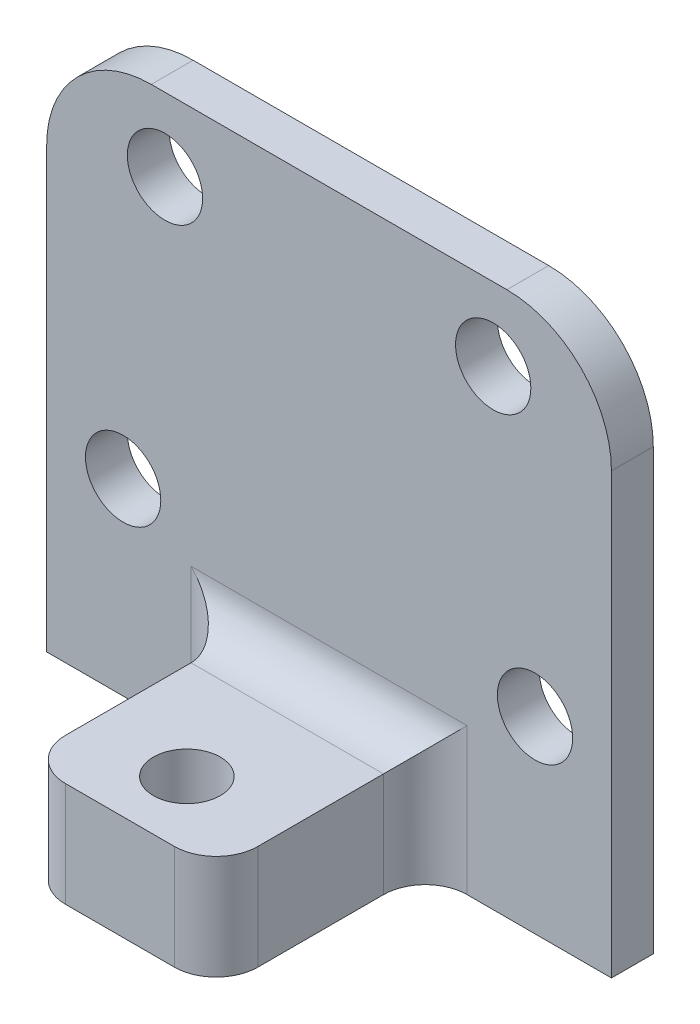
ISO-10303-21;
HEADER;
FILE_DESCRIPTION(('STEP AP214'),'2;1');
FILE_NAME('part.step','',(''),(''),'','','');
FILE_SCHEMA(('AUTOMOTIVE_DESIGN { 1 0 10303 214 1 1 1 1 }'));
ENDSEC;
DATA;
#1=APPLICATION_CONTEXT('core data for automotive mechanical design processes');
#2=APPLICATION_PROTOCOL_DEFINITION('international standard','automotive_design',2000,#1);
#3=PRODUCT_CONTEXT('',#1,'mechanical');
#4=PRODUCT('Part','Part','',(#3));
#5=PRODUCT_RELATED_PRODUCT_CATEGORY('part','',(#4));
#6=PRODUCT_DEFINITION_FORMATION('','',#4);
#7=PRODUCT_DEFINITION_CONTEXT('part definition',#1,'design');
#8=PRODUCT_DEFINITION('design','',#6,#7);
#9=PRODUCT_DEFINITION_SHAPE('','',#8);
#10=(LENGTH_UNIT() NAMED_UNIT(*) SI_UNIT(.MILLI.,.METRE.));
#11=(NAMED_UNIT(*) PLANE_ANGLE_UNIT() SI_UNIT($,.RADIAN.));
#12=(NAMED_UNIT(*) SI_UNIT($,.STERADIAN.) SOLID_ANGLE_UNIT());
#13=UNCERTAINTY_MEASURE_WITH_UNIT(LENGTH_MEASURE(1.E-05),#10,'distance_accuracy_value','');
#14=(GEOMETRIC_REPRESENTATION_CONTEXT(3) GLOBAL_UNCERTAINTY_ASSIGNED_CONTEXT((#13)) GLOBAL_UNIT_ASSIGNED_CONTEXT((#10,
#11,#12)) REPRESENTATION_CONTEXT('',''));
#15=CARTESIAN_POINT('',(0.,0.,0.));
#16=DIRECTION('',(0.,0.,1.));
#17=DIRECTION('',(1.,0.,0.));
#18=AXIS2_PLACEMENT_3D('',#15,#16,#17);
#19=CARTESIAN_POINT('',(-13.5,26.,2.));
#20=DIRECTION('',(1.,0.,0.));
#21=DIRECTION('',(0.,1.,0.));
#22=AXIS2_PLACEMENT_3D('',#19,#20,#21);
#23=PLANE('',#22);
#24=DIRECTION('',(0.,-1.,0.));
#25=VECTOR('',#24,1.);
#26=CARTESIAN_POINT('',(-13.5,26.,2.));
#27=LINE('',#26,#25);
#28=CARTESIAN_POINT('',(-13.5,21.,2.));
#29=VERTEX_POINT('',#28);
#30=CARTESIAN_POINT('',(-13.5,0.,2.));
#31=VERTEX_POINT('',#30);
#32=EDGE_CURVE('E152',#29,#31,#27,.T.);
#33=ORIENTED_EDGE('',*,*,#32,.F.);
#34=DIRECTION('',(0.,0.,-1.));
#35=VECTOR('',#34,1.);
#36=CARTESIAN_POINT('',(-13.5,21.,2.));
#37=LINE('',#36,#35);
#38=CARTESIAN_POINT('',(-13.5,21.,0.));
#39=VERTEX_POINT('',#38);
#40=EDGE_CURVE('E165',#29,#39,#37,.T.);
#41=ORIENTED_EDGE('',*,*,#40,.T.);
#42=DIRECTION('',(0.,-1.,0.));
#43=VECTOR('',#42,1.);
#44=CARTESIAN_POINT('',(-13.5,26.,0.));
#45=LINE('',#44,#43);
#46=CARTESIAN_POINT('',(-13.5,0.,0.));
#47=VERTEX_POINT('',#46);
#48=EDGE_CURVE('E164',#39,#47,#45,.T.);
#49=ORIENTED_EDGE('',*,*,#48,.T.);
#50=DIRECTION('',(0.,0.,-1.));
#51=VECTOR('',#50,1.);
#52=CARTESIAN_POINT('',(-13.5,0.,2.));
#53=LINE('',#52,#51);
#54=EDGE_CURVE('E142',#31,#47,#53,.T.);
#55=ORIENTED_EDGE('',*,*,#54,.F.);
#56=EDGE_LOOP('',(#33,#41,#49,#55));
#57=FACE_BOUND('',#56,.T.);
#58=ADVANCED_FACE('F37',(#57),#23,.F.);
#59=CARTESIAN_POINT('',(-13.5,0.,2.));
#60=DIRECTION('',(0.,1.,0.));
#61=DIRECTION('',(0.,0.,1.));
#62=AXIS2_PLACEMENT_3D('',#59,#60,#61);
#63=PLANE('',#62);
#64=CARTESIAN_POINT('',(0.,0.,8.8));
#65=DIRECTION('',(0.,-1.,0.));
#66=DIRECTION('',(0.,0.,-1.));
#67=AXIS2_PLACEMENT_3D('',#64,#65,#66);
#68=CIRCLE('',#67,1.6);
#69=CARTESIAN_POINT('',(0.,0.,7.2));
#70=VERTEX_POINT('',#69);
#71=EDGE_CURVE('E273',#70,#70,#68,.T.);
#72=ORIENTED_EDGE('',*,*,#71,.F.);
#73=EDGE_LOOP('',(#72));
#74=FACE_BOUND('',#73,.T.);
#75=DIRECTION('',(1.,0.,0.));
#76=VECTOR('',#75,1.);
#77=CARTESIAN_POINT('',(-13.5,0.,12.));
#78=LINE('',#77,#76);
#79=CARTESIAN_POINT('',(-2.6,0.,12.));
#80=VERTEX_POINT('',#79);
#81=CARTESIAN_POINT('',(2.6,0.,12.));
#82=VERTEX_POINT('',#81);
#83=EDGE_CURVE('E249',#80,#82,#78,.T.);
#84=ORIENTED_EDGE('',*,*,#83,.F.);
#85=CARTESIAN_POINT('',(-2.6,0.,10.));
#86=DIRECTION('',(0.,1.,0.));
#87=DIRECTION('',(0.,0.,1.));
#88=AXIS2_PLACEMENT_3D('',#85,#86,#87);
#89=CIRCLE('',#88,2.);
#90=CARTESIAN_POINT('',(-4.6,0.,10.));
#91=VERTEX_POINT('',#90);
#92=EDGE_CURVE('E45',#80,#91,#89,.F.);
#93=ORIENTED_EDGE('',*,*,#92,.T.);
#94=DIRECTION('',(0.,0.,-1.));
#95=VECTOR('',#94,1.);
#96=CARTESIAN_POINT('',(-4.6,0.,12.));
#97=LINE('',#96,#95);
#98=CARTESIAN_POINT('',(-4.6,0.,4.));
#99=VERTEX_POINT('',#98);
#100=EDGE_CURVE('E149',#91,#99,#97,.T.);
#101=ORIENTED_EDGE('',*,*,#100,.T.);
#102=CARTESIAN_POINT('',(-6.6,0.,4.));
#103=DIRECTION('',(0.,1.,0.));
#104=DIRECTION('',(0.,0.,1.));
#105=AXIS2_PLACEMENT_3D('',#102,#103,#104);
#106=CIRCLE('',#105,2.);
#107=CARTESIAN_POINT('',(-6.6,0.,2.));
#108=VERTEX_POINT('',#107);
#109=EDGE_CURVE('E145',#99,#108,#106,.T.);
#110=ORIENTED_EDGE('',*,*,#109,.T.);
#111=DIRECTION('',(-1.,0.,0.));
#112=VECTOR('',#111,1.);
#113=CARTESIAN_POINT('',(-13.5,0.,2.));
#114=LINE('',#113,#112);
#115=EDGE_CURVE('E137',#108,#31,#114,.T.);
#116=ORIENTED_EDGE('',*,*,#115,.T.);
#117=ORIENTED_EDGE('',*,*,#54,.T.);
#118=DIRECTION('',(1.,0.,0.));
#119=VECTOR('',#118,1.);
#120=CARTESIAN_POINT('',(-13.5,0.,0.));
#121=LINE('',#120,#119);
#122=CARTESIAN_POINT('',(13.5,0.,0.));
#123=VERTEX_POINT('',#122);
#124=EDGE_CURVE('E183',#47,#123,#121,.T.);
#125=ORIENTED_EDGE('',*,*,#124,.T.);
#126=DIRECTION('',(0.,0.,-1.));
#127=VECTOR('',#126,1.);
#128=CARTESIAN_POINT('',(13.5,0.,2.));
#129=LINE('',#128,#127);
#130=CARTESIAN_POINT('',(13.5,0.,2.));
#131=VERTEX_POINT('',#130);
#132=EDGE_CURVE('E166',#131,#123,#129,.T.);
#133=ORIENTED_EDGE('',*,*,#132,.F.);
#134=DIRECTION('',(1.,0.,0.));
#135=VECTOR('',#134,1.);
#136=CARTESIAN_POINT('',(13.5,0.,2.));
#137=LINE('',#136,#135);
#138=CARTESIAN_POINT('',(6.6,0.,2.));
#139=VERTEX_POINT('',#138);
#140=EDGE_CURVE('E276',#139,#131,#137,.T.);
#141=ORIENTED_EDGE('',*,*,#140,.F.);
#142=CARTESIAN_POINT('',(6.6,0.,4.));
#143=DIRECTION('',(0.,1.,0.));
#144=DIRECTION('',(0.,0.,1.));
#145=AXIS2_PLACEMENT_3D('',#142,#143,#144);
#146=CIRCLE('',#145,2.);
#147=CARTESIAN_POINT('',(4.6,0.,4.));
#148=VERTEX_POINT('',#147);
#149=EDGE_CURVE('E226',#139,#148,#146,.T.);
#150=ORIENTED_EDGE('',*,*,#149,.T.);
#151=DIRECTION('',(0.,0.,-1.));
#152=VECTOR('',#151,1.);
#153=CARTESIAN_POINT('',(4.6,0.,12.));
#154=LINE('',#153,#152);
#155=CARTESIAN_POINT('',(4.6,0.,10.));
#156=VERTEX_POINT('',#155);
#157=EDGE_CURVE('E280',#156,#148,#154,.T.);
#158=ORIENTED_EDGE('',*,*,#157,.F.);
#159=CARTESIAN_POINT('',(2.6,0.,10.));
#160=DIRECTION('',(0.,1.,0.));
#161=DIRECTION('',(0.,0.,1.));
#162=AXIS2_PLACEMENT_3D('',#159,#160,#161);
#163=CIRCLE('',#162,2.);
#164=EDGE_CURVE('E57',#156,#82,#163,.F.);
#165=ORIENTED_EDGE('',*,*,#164,.T.);
#166=EDGE_LOOP('',(#84,#93,#101,#110,#116,#117,#125,#133,#141,#150,#158,#165));
#167=FACE_BOUND('',#166,.T.);
#168=ADVANCED_FACE('F139',(#74,#167),#63,.F.);
#169=CARTESIAN_POINT('',(-13.5,5.,12.));
#170=DIRECTION('',(0.,-1.,0.));
#171=DIRECTION('',(0.,0.,-1.));
#172=AXIS2_PLACEMENT_3D('',#169,#170,#171);
#173=PLANE('',#172);
#174=CARTESIAN_POINT('',(0.,5.,8.8));
#175=DIRECTION('',(0.,-1.,0.));
#176=DIRECTION('',(0.,0.,-1.));
#177=AXIS2_PLACEMENT_3D('',#174,#175,#176);
#178=CIRCLE('',#177,1.6);
#179=CARTESIAN_POINT('',(0.,5.,7.2));
#180=VERTEX_POINT('',#179);
#181=EDGE_CURVE('E268',#180,#180,#178,.F.);
#182=ORIENTED_EDGE('',*,*,#181,.F.);
#183=EDGE_LOOP('',(#182));
#184=FACE_BOUND('',#183,.T.);
#185=DIRECTION('',(0.,0.,1.));
#186=VECTOR('',#185,1.);
#187=CARTESIAN_POINT('',(-4.6,5.,12.));
#188=LINE('',#187,#186);
#189=CARTESIAN_POINT('',(-4.6,5.,4.));
#190=VERTEX_POINT('',#189);
#191=CARTESIAN_POINT('',(-4.6,5.,10.));
#192=VERTEX_POINT('',#191);
#193=EDGE_CURVE('E148',#190,#192,#188,.T.);
#194=ORIENTED_EDGE('',*,*,#193,.T.);
#195=CARTESIAN_POINT('',(-2.6,5.,10.));
#196=DIRECTION('',(0.,-1.,0.));
#197=DIRECTION('',(0.,0.,-1.));
#198=AXIS2_PLACEMENT_3D('',#195,#196,#197);
#199=CIRCLE('',#198,2.);
#200=CARTESIAN_POINT('',(-2.6,5.,12.));
#201=VERTEX_POINT('',#200);
#202=EDGE_CURVE('E240',#192,#201,#199,.F.);
#203=ORIENTED_EDGE('',*,*,#202,.T.);
#204=DIRECTION('',(-1.,0.,0.));
#205=VECTOR('',#204,1.);
#206=CARTESIAN_POINT('',(-13.5,5.,12.));
#207=LINE('',#206,#205);
#208=CARTESIAN_POINT('',(2.6,5.,12.));
#209=VERTEX_POINT('',#208);
#210=EDGE_CURVE('E184',#209,#201,#207,.T.);
#211=ORIENTED_EDGE('',*,*,#210,.F.);
#212=CARTESIAN_POINT('',(2.6,5.,10.));
#213=DIRECTION('',(0.,-1.,0.));
#214=DIRECTION('',(0.,0.,-1.));
#215=AXIS2_PLACEMENT_3D('',#212,#213,#214);
#216=CIRCLE('',#215,2.);
#217=CARTESIAN_POINT('',(4.6,5.,10.));
#218=VERTEX_POINT('',#217);
#219=EDGE_CURVE('E238',#209,#218,#216,.F.);
#220=ORIENTED_EDGE('',*,*,#219,.T.);
#221=DIRECTION('',(0.,0.,1.));
#222=VECTOR('',#221,1.);
#223=CARTESIAN_POINT('',(4.6,5.,12.));
#224=LINE('',#223,#222);
#225=CARTESIAN_POINT('',(4.6,5.,4.));
#226=VERTEX_POINT('',#225);
#227=EDGE_CURVE('E278',#226,#218,#224,.T.);
#228=ORIENTED_EDGE('',*,*,#227,.F.);
#229=DIRECTION('',(-1.,0.,0.));
#230=VECTOR('',#229,1.);
#231=CARTESIAN_POINT('',(-13.5,5.,4.));
#232=LINE('',#231,#230);
#233=EDGE_CURVE('E211',#226,#190,#232,.T.);
#234=ORIENTED_EDGE('',*,*,#233,.T.);
#235=EDGE_LOOP('',(#194,#203,#211,#220,#228,#234));
#236=FACE_BOUND('',#235,.T.);
#237=ADVANCED_FACE('F264',(#184,#236),#173,.F.);
#238=CARTESIAN_POINT('',(-13.5,5.,12.));
#239=DIRECTION('',(0.,0.,-1.));
#240=DIRECTION('',(-1.,0.,0.));
#241=AXIS2_PLACEMENT_3D('',#238,#239,#240);
#242=PLANE('',#241);
#243=ORIENTED_EDGE('',*,*,#210,.T.);
#244=DIRECTION('',(0.,1.,0.));
#245=VECTOR('',#244,1.);
#246=CARTESIAN_POINT('',(-2.6,0.,12.));
#247=LINE('',#246,#245);
#248=EDGE_CURVE('E245',#201,#80,#247,.F.);
#249=ORIENTED_EDGE('',*,*,#248,.T.);
#250=ORIENTED_EDGE('',*,*,#83,.T.);
#251=DIRECTION('',(0.,1.,0.));
#252=VECTOR('',#251,1.);
#253=CARTESIAN_POINT('',(2.6,5.,12.));
#254=LINE('',#253,#252);
#255=EDGE_CURVE('E242',#82,#209,#254,.T.);
#256=ORIENTED_EDGE('',*,*,#255,.T.);
#257=EDGE_LOOP('',(#243,#249,#250,#256));
#258=FACE_BOUND('',#257,.T.);
#259=ADVANCED_FACE('F266',(#258),#242,.F.);
#260=CARTESIAN_POINT('',(13.5,26.,2.));
#261=DIRECTION('',(-1.,0.,0.));
#262=DIRECTION('',(0.,-1.,0.));
#263=AXIS2_PLACEMENT_3D('',#260,#261,#262);
#264=PLANE('',#263);
#265=DIRECTION('',(0.,1.,0.));
#266=VECTOR('',#265,1.);
#267=CARTESIAN_POINT('',(13.5,26.,0.));
#268=LINE('',#267,#266);
#269=CARTESIAN_POINT('',(13.5,21.,0.));
#270=VERTEX_POINT('',#269);
#271=EDGE_CURVE('E186',#123,#270,#268,.T.);
#272=ORIENTED_EDGE('',*,*,#271,.T.);
#273=DIRECTION('',(0.,0.,-1.));
#274=VECTOR('',#273,1.);
#275=CARTESIAN_POINT('',(13.5,21.,2.));
#276=LINE('',#275,#274);
#277=CARTESIAN_POINT('',(13.5,21.,2.));
#278=VERTEX_POINT('',#277);
#279=EDGE_CURVE('E209',#270,#278,#276,.F.);
#280=ORIENTED_EDGE('',*,*,#279,.T.);
#281=DIRECTION('',(0.,1.,0.));
#282=VECTOR('',#281,1.);
#283=CARTESIAN_POINT('',(13.5,26.,2.));
#284=LINE('',#283,#282);
#285=EDGE_CURVE('E160',#131,#278,#284,.T.);
#286=ORIENTED_EDGE('',*,*,#285,.F.);
#287=ORIENTED_EDGE('',*,*,#132,.T.);
#288=EDGE_LOOP('',(#272,#280,#286,#287));
#289=FACE_BOUND('',#288,.T.);
#290=ADVANCED_FACE('F324',(#289),#264,.F.);
#291=CARTESIAN_POINT('',(-13.5,26.,2.));
#292=DIRECTION('',(0.,-1.,0.));
#293=DIRECTION('',(0.,0.,-1.));
#294=AXIS2_PLACEMENT_3D('',#291,#292,#293);
#295=PLANE('',#294);
#296=DIRECTION('',(-1.,0.,0.));
#297=VECTOR('',#296,1.);
#298=CARTESIAN_POINT('',(-13.5,26.,0.));
#299=LINE('',#298,#297);
#300=CARTESIAN_POINT('',(8.5,26.,0.));
#301=VERTEX_POINT('',#300);
#302=CARTESIAN_POINT('',(-8.5,26.,0.));
#303=VERTEX_POINT('',#302);
#304=EDGE_CURVE('E161',#301,#303,#299,.T.);
#305=ORIENTED_EDGE('',*,*,#304,.T.);
#306=DIRECTION('',(0.,0.,-1.));
#307=VECTOR('',#306,1.);
#308=CARTESIAN_POINT('',(-8.5,26.,2.));
#309=LINE('',#308,#307);
#310=CARTESIAN_POINT('',(-8.5,26.,2.));
#311=VERTEX_POINT('',#310);
#312=EDGE_CURVE('E195',#303,#311,#309,.F.);
#313=ORIENTED_EDGE('',*,*,#312,.T.);
#314=DIRECTION('',(-1.,0.,0.));
#315=VECTOR('',#314,1.);
#316=CARTESIAN_POINT('',(-13.5,26.,2.));
#317=LINE('',#316,#315);
#318=CARTESIAN_POINT('',(8.5,26.,2.));
#319=VERTEX_POINT('',#318);
#320=EDGE_CURVE('E170',#319,#311,#317,.T.);
#321=ORIENTED_EDGE('',*,*,#320,.F.);
#322=DIRECTION('',(0.,0.,-1.));
#323=VECTOR('',#322,1.);
#324=CARTESIAN_POINT('',(8.5,26.,2.));
#325=LINE('',#324,#323);
#326=EDGE_CURVE('E197',#319,#301,#325,.T.);
#327=ORIENTED_EDGE('',*,*,#326,.T.);
#328=EDGE_LOOP('',(#305,#313,#321,#327));
#329=FACE_BOUND('',#328,.T.);
#330=ADVANCED_FACE('F193',(#329),#295,.F.);
#331=CARTESIAN_POINT('',(-13.5,0.,2.));
#332=DIRECTION('',(0.,0.,1.));
#333=DIRECTION('',(1.,0.,0.));
#334=AXIS2_PLACEMENT_3D('',#331,#332,#333);
#335=PLANE('',#334);
#336=CARTESIAN_POINT('',(-9.84658019700406,9.,2.));
#337=DIRECTION('',(0.,0.,1.));
#338=DIRECTION('',(1.,0.,0.));
#339=AXIS2_PLACEMENT_3D('',#336,#337,#338);
#340=CIRCLE('',#339,1.8);
#341=CARTESIAN_POINT('',(-8.04658019700406,9.,2.));
#342=VERTEX_POINT('',#341);
#343=EDGE_CURVE('E235',#342,#342,#340,.F.);
#344=ORIENTED_EDGE('',*,*,#343,.T.);
#345=EDGE_LOOP('',(#344));
#346=FACE_BOUND('',#345,.T.);
#347=CARTESIAN_POINT('',(9.84658019700406,9.,2.));
#348=DIRECTION('',(0.,0.,1.));
#349=DIRECTION('',(1.,0.,0.));
#350=AXIS2_PLACEMENT_3D('',#347,#348,#349);
#351=CIRCLE('',#350,1.8);
#352=CARTESIAN_POINT('',(11.6465801970041,9.,2.));
#353=VERTEX_POINT('',#352);
#354=EDGE_CURVE('E295',#353,#353,#351,.F.);
#355=ORIENTED_EDGE('',*,*,#354,.T.);
#356=EDGE_LOOP('',(#355));
#357=FACE_BOUND('',#356,.T.);
#358=CARTESIAN_POINT('',(-7.84587453407535,22.5,2.));
#359=DIRECTION('',(0.,0.,1.));
#360=DIRECTION('',(1.,0.,0.));
#361=AXIS2_PLACEMENT_3D('',#358,#359,#360);
#362=CIRCLE('',#361,1.8);
#363=CARTESIAN_POINT('',(-6.04587453407535,22.5,2.));
#364=VERTEX_POINT('',#363);
#365=EDGE_CURVE('E289',#364,#364,#362,.F.);
#366=ORIENTED_EDGE('',*,*,#365,.T.);
#367=EDGE_LOOP('',(#366));
#368=FACE_BOUND('',#367,.T.);
#369=CARTESIAN_POINT('',(7.84587453407535,22.5,2.));
#370=DIRECTION('',(0.,0.,1.));
#371=DIRECTION('',(1.,0.,0.));
#372=AXIS2_PLACEMENT_3D('',#369,#370,#371);
#373=CIRCLE('',#372,1.8);
#374=CARTESIAN_POINT('',(9.64587453407535,22.5,2.));
#375=VERTEX_POINT('',#374);
#376=EDGE_CURVE('E283',#375,#375,#373,.F.);
#377=ORIENTED_EDGE('',*,*,#376,.T.);
#378=EDGE_LOOP('',(#377));
#379=FACE_BOUND('',#378,.T.);
#380=ORIENTED_EDGE('',*,*,#115,.F.);
#381=DIRECTION('',(0.,1.,0.));
#382=VECTOR('',#381,1.);
#383=CARTESIAN_POINT('',(-6.6,5.,2.));
#384=LINE('',#383,#382);
#385=CARTESIAN_POINT('',(-6.6,7.,2.));
#386=VERTEX_POINT('',#385);
#387=EDGE_CURVE('E218',#108,#386,#384,.T.);
#388=ORIENTED_EDGE('',*,*,#387,.T.);
#389=DIRECTION('',(-1.,0.,0.));
#390=VECTOR('',#389,1.);
#391=CARTESIAN_POINT('',(-13.5,7.,2.));
#392=LINE('',#391,#390);
#393=CARTESIAN_POINT('',(6.6,7.,2.));
#394=VERTEX_POINT('',#393);
#395=EDGE_CURVE('E216',#386,#394,#392,.F.);
#396=ORIENTED_EDGE('',*,*,#395,.T.);
#397=DIRECTION('',(0.,1.,0.));
#398=VECTOR('',#397,1.);
#399=CARTESIAN_POINT('',(6.6,0.,2.));
#400=LINE('',#399,#398);
#401=EDGE_CURVE('E214',#394,#139,#400,.F.);
#402=ORIENTED_EDGE('',*,*,#401,.T.);
#403=ORIENTED_EDGE('',*,*,#140,.T.);
#404=ORIENTED_EDGE('',*,*,#285,.T.);
#405=CARTESIAN_POINT('',(8.5,21.,2.));
#406=DIRECTION('',(0.,0.,1.));
#407=DIRECTION('',(1.,0.,0.));
#408=AXIS2_PLACEMENT_3D('',#405,#406,#407);
#409=CIRCLE('',#408,5.);
#410=EDGE_CURVE('E202',#278,#319,#409,.T.);
#411=ORIENTED_EDGE('',*,*,#410,.T.);
#412=ORIENTED_EDGE('',*,*,#320,.T.);
#413=CARTESIAN_POINT('',(-8.5,21.,2.));
#414=DIRECTION('',(0.,0.,1.));
#415=DIRECTION('',(1.,0.,0.));
#416=AXIS2_PLACEMENT_3D('',#413,#414,#415);
#417=CIRCLE('',#416,5.);
#418=EDGE_CURVE('E156',#311,#29,#417,.T.);
#419=ORIENTED_EDGE('',*,*,#418,.T.);
#420=ORIENTED_EDGE('',*,*,#32,.T.);
#421=EDGE_LOOP('',(#380,#388,#396,#402,#403,#404,#411,#412,#419,#420));
#422=FACE_BOUND('',#421,.T.);
#423=ADVANCED_FACE('F153',(#346,#357,#368,#379,#422),#335,.T.);
#424=CARTESIAN_POINT('',(-13.5,0.,0.));
#425=DIRECTION('',(0.,0.,1.));
#426=DIRECTION('',(1.,0.,0.));
#427=AXIS2_PLACEMENT_3D('',#424,#425,#426);
#428=PLANE('',#427);
#429=CARTESIAN_POINT('',(-9.84658019700406,9.,0.));
#430=DIRECTION('',(0.,0.,-1.));
#431=DIRECTION('',(-1.,0.,0.));
#432=AXIS2_PLACEMENT_3D('',#429,#430,#431);
#433=CIRCLE('',#432,1.8);
#434=CARTESIAN_POINT('',(-11.6465801970041,9.,0.));
#435=VERTEX_POINT('',#434);
#436=EDGE_CURVE('E298',#435,#435,#433,.T.);
#437=ORIENTED_EDGE('',*,*,#436,.F.);
#438=EDGE_LOOP('',(#437));
#439=FACE_BOUND('',#438,.T.);
#440=CARTESIAN_POINT('',(9.84658019700406,9.,0.));
#441=DIRECTION('',(0.,0.,-1.));
#442=DIRECTION('',(-1.,0.,0.));
#443=AXIS2_PLACEMENT_3D('',#440,#441,#442);
#444=CIRCLE('',#443,1.8);
#445=CARTESIAN_POINT('',(8.04658019700406,9.,0.));
#446=VERTEX_POINT('',#445);
#447=EDGE_CURVE('E292',#446,#446,#444,.T.);
#448=ORIENTED_EDGE('',*,*,#447,.F.);
#449=EDGE_LOOP('',(#448));
#450=FACE_BOUND('',#449,.T.);
#451=CARTESIAN_POINT('',(-7.84587453407535,22.5,0.));
#452=DIRECTION('',(0.,0.,-1.));
#453=DIRECTION('',(-1.,0.,0.));
#454=AXIS2_PLACEMENT_3D('',#451,#452,#453);
#455=CIRCLE('',#454,1.8);
#456=CARTESIAN_POINT('',(-9.64587453407535,22.5,0.));
#457=VERTEX_POINT('',#456);
#458=EDGE_CURVE('E286',#457,#457,#455,.T.);
#459=ORIENTED_EDGE('',*,*,#458,.F.);
#460=EDGE_LOOP('',(#459));
#461=FACE_BOUND('',#460,.T.);
#462=CARTESIAN_POINT('',(7.84587453407535,22.5,0.));
#463=DIRECTION('',(0.,0.,-1.));
#464=DIRECTION('',(-1.,0.,0.));
#465=AXIS2_PLACEMENT_3D('',#462,#463,#464);
#466=CIRCLE('',#465,1.8);
#467=CARTESIAN_POINT('',(6.04587453407535,22.5,0.));
#468=VERTEX_POINT('',#467);
#469=EDGE_CURVE('E258',#468,#468,#466,.T.);
#470=ORIENTED_EDGE('',*,*,#469,.F.);
#471=EDGE_LOOP('',(#470));
#472=FACE_BOUND('',#471,.T.);
#473=ORIENTED_EDGE('',*,*,#48,.F.);
#474=CARTESIAN_POINT('',(-8.5,21.,0.));
#475=DIRECTION('',(0.,0.,1.));
#476=DIRECTION('',(1.,0.,0.));
#477=AXIS2_PLACEMENT_3D('',#474,#475,#476);
#478=CIRCLE('',#477,5.);
#479=EDGE_CURVE('E201',#39,#303,#478,.F.);
#480=ORIENTED_EDGE('',*,*,#479,.T.);
#481=ORIENTED_EDGE('',*,*,#304,.F.);
#482=CARTESIAN_POINT('',(8.5,21.,0.));
#483=DIRECTION('',(0.,0.,1.));
#484=DIRECTION('',(1.,0.,0.));
#485=AXIS2_PLACEMENT_3D('',#482,#483,#484);
#486=CIRCLE('',#485,5.);
#487=EDGE_CURVE('E168',#301,#270,#486,.F.);
#488=ORIENTED_EDGE('',*,*,#487,.T.);
#489=ORIENTED_EDGE('',*,*,#271,.F.);
#490=ORIENTED_EDGE('',*,*,#124,.F.);
#491=EDGE_LOOP('',(#473,#480,#481,#488,#489,#490));
#492=FACE_BOUND('',#491,.T.);
#493=ADVANCED_FACE('F308',(#439,#450,#461,#472,#492),#428,.F.);
#494=CARTESIAN_POINT('',(0.,26.001025,8.8));
#495=DIRECTION('',(0.,-1.,0.));
#496=DIRECTION('',(0.,0.,-1.));
#497=AXIS2_PLACEMENT_3D('',#494,#495,#496);
#498=CYLINDRICAL_SURFACE('',#497,1.6);
#499=ORIENTED_EDGE('',*,*,#71,.T.);
#500=EDGE_LOOP('',(#499));
#501=FACE_BOUND('',#500,.T.);
#502=ORIENTED_EDGE('',*,*,#181,.T.);
#503=EDGE_LOOP('',(#502));
#504=FACE_BOUND('',#503,.T.);
#505=ADVANCED_FACE('F311',(#501,#504),#498,.F.);
#506=CARTESIAN_POINT('',(4.6,-0.00100000000000013,12.));
#507=DIRECTION('',(-1.,0.,0.));
#508=DIRECTION('',(0.,0.,1.));
#509=AXIS2_PLACEMENT_3D('',#506,#507,#508);
#510=PLANE('',#509);
#511=ORIENTED_EDGE('',*,*,#227,.T.);
#512=DIRECTION('',(0.,1.,0.));
#513=VECTOR('',#512,1.);
#514=CARTESIAN_POINT('',(4.6,-0.00100000000000013,10.));
#515=LINE('',#514,#513);
#516=EDGE_CURVE('E11',#218,#156,#515,.F.);
#517=ORIENTED_EDGE('',*,*,#516,.T.);
#518=ORIENTED_EDGE('',*,*,#157,.T.);
#519=DIRECTION('',(0.,1.,0.));
#520=VECTOR('',#519,1.);
#521=CARTESIAN_POINT('',(4.6,-0.00100000000000013,4.));
#522=LINE('',#521,#520);
#523=EDGE_CURVE('E223',#148,#226,#522,.T.);
#524=ORIENTED_EDGE('',*,*,#523,.T.);
#525=EDGE_LOOP('',(#511,#517,#518,#524));
#526=FACE_BOUND('',#525,.T.);
#527=ADVANCED_FACE('F365',(#526),#510,.F.);
#528=CARTESIAN_POINT('',(-4.6,-0.00100000000000013,12.));
#529=DIRECTION('',(-1.,0.,0.));
#530=DIRECTION('',(0.,0.,1.));
#531=AXIS2_PLACEMENT_3D('',#528,#529,#530);
#532=PLANE('',#531);
#533=ORIENTED_EDGE('',*,*,#100,.F.);
#534=DIRECTION('',(0.,1.,0.));
#535=VECTOR('',#534,1.);
#536=CARTESIAN_POINT('',(-4.6,5.,10.));
#537=LINE('',#536,#535);
#538=EDGE_CURVE('E229',#91,#192,#537,.T.);
#539=ORIENTED_EDGE('',*,*,#538,.T.);
#540=ORIENTED_EDGE('',*,*,#193,.F.);
#541=DIRECTION('',(0.,1.,0.));
#542=VECTOR('',#541,1.);
#543=CARTESIAN_POINT('',(-4.6,0.,4.));
#544=LINE('',#543,#542);
#545=EDGE_CURVE('E220',#190,#99,#544,.F.);
#546=ORIENTED_EDGE('',*,*,#545,.T.);
#547=EDGE_LOOP('',(#533,#539,#540,#546));
#548=FACE_BOUND('',#547,.T.);
#549=ADVANCED_FACE('F254',(#548),#532,.T.);
#550=CARTESIAN_POINT('',(7.84587453407535,22.5,12.001));
#551=DIRECTION('',(0.,0.,-1.));
#552=DIRECTION('',(-1.,0.,0.));
#553=AXIS2_PLACEMENT_3D('',#550,#551,#552);
#554=CYLINDRICAL_SURFACE('',#553,1.8);
#555=ORIENTED_EDGE('',*,*,#376,.F.);
#556=EDGE_LOOP('',(#555));
#557=FACE_BOUND('',#556,.T.);
#558=ORIENTED_EDGE('',*,*,#469,.T.);
#559=EDGE_LOOP('',(#558));
#560=FACE_BOUND('',#559,.T.);
#561=ADVANCED_FACE('F371',(#557,#560),#554,.F.);
#562=CARTESIAN_POINT('',(-7.84587453407535,22.5,12.001));
#563=DIRECTION('',(0.,0.,-1.));
#564=DIRECTION('',(-1.,0.,0.));
#565=AXIS2_PLACEMENT_3D('',#562,#563,#564);
#566=CYLINDRICAL_SURFACE('',#565,1.8);
#567=ORIENTED_EDGE('',*,*,#365,.F.);
#568=EDGE_LOOP('',(#567));
#569=FACE_BOUND('',#568,.T.);
#570=ORIENTED_EDGE('',*,*,#458,.T.);
#571=EDGE_LOOP('',(#570));
#572=FACE_BOUND('',#571,.T.);
#573=ADVANCED_FACE('F374',(#569,#572),#566,.F.);
#574=CARTESIAN_POINT('',(9.84658019700406,9.,12.001));
#575=DIRECTION('',(0.,0.,-1.));
#576=DIRECTION('',(-1.,0.,0.));
#577=AXIS2_PLACEMENT_3D('',#574,#575,#576);
#578=CYLINDRICAL_SURFACE('',#577,1.8);
#579=ORIENTED_EDGE('',*,*,#354,.F.);
#580=EDGE_LOOP('',(#579));
#581=FACE_BOUND('',#580,.T.);
#582=ORIENTED_EDGE('',*,*,#447,.T.);
#583=EDGE_LOOP('',(#582));
#584=FACE_BOUND('',#583,.T.);
#585=ADVANCED_FACE('F378',(#581,#584),#578,.F.);
#586=CARTESIAN_POINT('',(-9.84658019700406,9.,12.001));
#587=DIRECTION('',(0.,0.,-1.));
#588=DIRECTION('',(-1.,0.,0.));
#589=AXIS2_PLACEMENT_3D('',#586,#587,#588);
#590=CYLINDRICAL_SURFACE('',#589,1.8);
#591=ORIENTED_EDGE('',*,*,#343,.F.);
#592=EDGE_LOOP('',(#591));
#593=FACE_BOUND('',#592,.T.);
#594=ORIENTED_EDGE('',*,*,#436,.T.);
#595=EDGE_LOOP('',(#594));
#596=FACE_BOUND('',#595,.T.);
#597=ADVANCED_FACE('F306',(#593,#596),#590,.F.);
#598=CARTESIAN_POINT('',(-8.5,21.,2.));
#599=DIRECTION('',(0.,0.,-1.));
#600=DIRECTION('',(-1.,0.,0.));
#601=AXIS2_PLACEMENT_3D('',#598,#599,#600);
#602=CYLINDRICAL_SURFACE('',#601,5.);
#603=ORIENTED_EDGE('',*,*,#418,.F.);
#604=ORIENTED_EDGE('',*,*,#312,.F.);
#605=ORIENTED_EDGE('',*,*,#479,.F.);
#606=ORIENTED_EDGE('',*,*,#40,.F.);
#607=EDGE_LOOP('',(#603,#604,#605,#606));
#608=FACE_BOUND('',#607,.T.);
#609=ADVANCED_FACE('F200',(#608),#602,.T.);
#610=CARTESIAN_POINT('',(8.5,21.,2.));
#611=DIRECTION('',(0.,0.,-1.));
#612=DIRECTION('',(-1.,0.,0.));
#613=AXIS2_PLACEMENT_3D('',#610,#611,#612);
#614=CYLINDRICAL_SURFACE('',#613,5.);
#615=ORIENTED_EDGE('',*,*,#410,.F.);
#616=ORIENTED_EDGE('',*,*,#279,.F.);
#617=ORIENTED_EDGE('',*,*,#487,.F.);
#618=ORIENTED_EDGE('',*,*,#326,.F.);
#619=EDGE_LOOP('',(#615,#616,#617,#618));
#620=FACE_BOUND('',#619,.T.);
#621=ADVANCED_FACE('F328',(#620),#614,.T.);
#622=CARTESIAN_POINT('',(6.6,-0.00100000000000013,4.));
#623=DIRECTION('',(0.,1.,0.));
#624=DIRECTION('',(0.,0.,1.));
#625=AXIS2_PLACEMENT_3D('',#622,#623,#624);
#626=CYLINDRICAL_SURFACE('',#625,2.);
#627=ORIENTED_EDGE('',*,*,#149,.F.);
#628=ORIENTED_EDGE('',*,*,#401,.F.);
#629=CARTESIAN_POINT('',(6.6,7.,4.));
#630=DIRECTION('',(-0.707106781186547,0.707106781186547,0.));
#631=DIRECTION('',(0.707106781186547,0.707106781186547,0.));
#632=AXIS2_PLACEMENT_3D('',#629,#630,#631);
#633=ELLIPSE('',#632,2.82842712474619,2.);
#634=EDGE_CURVE('E232',#226,#394,#633,.F.);
#635=ORIENTED_EDGE('',*,*,#634,.F.);
#636=ORIENTED_EDGE('',*,*,#523,.F.);
#637=EDGE_LOOP('',(#627,#628,#635,#636));
#638=FACE_BOUND('',#637,.T.);
#639=ADVANCED_FACE('F331',(#638),#626,.F.);
#640=CARTESIAN_POINT('',(-6.6,0.,4.));
#641=DIRECTION('',(0.,-1.,0.));
#642=DIRECTION('',(0.,0.,-1.));
#643=AXIS2_PLACEMENT_3D('',#640,#641,#642);
#644=CYLINDRICAL_SURFACE('',#643,2.);
#645=ORIENTED_EDGE('',*,*,#109,.F.);
#646=ORIENTED_EDGE('',*,*,#545,.F.);
#647=CARTESIAN_POINT('',(-6.6,7.,4.));
#648=DIRECTION('',(-0.707106781186547,-0.707106781186547,0.));
#649=DIRECTION('',(0.707106781186547,-0.707106781186547,0.));
#650=AXIS2_PLACEMENT_3D('',#647,#648,#649);
#651=ELLIPSE('',#650,2.82842712474619,2.);
#652=EDGE_CURVE('E230',#386,#190,#651,.T.);
#653=ORIENTED_EDGE('',*,*,#652,.F.);
#654=ORIENTED_EDGE('',*,*,#387,.F.);
#655=EDGE_LOOP('',(#645,#646,#653,#654));
#656=FACE_BOUND('',#655,.T.);
#657=ADVANCED_FACE('F337',(#656),#644,.F.);
#658=CARTESIAN_POINT('',(-13.5,7.,4.));
#659=DIRECTION('',(-1.,0.,0.));
#660=DIRECTION('',(0.,0.,1.));
#661=AXIS2_PLACEMENT_3D('',#658,#659,#660);
#662=CYLINDRICAL_SURFACE('',#661,2.);
#663=ORIENTED_EDGE('',*,*,#634,.T.);
#664=ORIENTED_EDGE('',*,*,#395,.F.);
#665=ORIENTED_EDGE('',*,*,#652,.T.);
#666=ORIENTED_EDGE('',*,*,#233,.F.);
#667=EDGE_LOOP('',(#663,#664,#665,#666));
#668=FACE_BOUND('',#667,.T.);
#669=ADVANCED_FACE('F432',(#668),#662,.F.);
#670=CARTESIAN_POINT('',(-2.6,-0.00100000000000013,10.));
#671=DIRECTION('',(0.,-1.,0.));
#672=DIRECTION('',(0.,0.,-1.));
#673=AXIS2_PLACEMENT_3D('',#670,#671,#672);
#674=CYLINDRICAL_SURFACE('',#673,2.);
#675=ORIENTED_EDGE('',*,*,#92,.F.);
#676=ORIENTED_EDGE('',*,*,#248,.F.);
#677=ORIENTED_EDGE('',*,*,#202,.F.);
#678=ORIENTED_EDGE('',*,*,#538,.F.);
#679=EDGE_LOOP('',(#675,#676,#677,#678));
#680=FACE_BOUND('',#679,.T.);
#681=ADVANCED_FACE('F260',(#680),#674,.T.);
#682=CARTESIAN_POINT('',(2.6,5.,10.));
#683=DIRECTION('',(0.,1.,0.));
#684=DIRECTION('',(0.,0.,1.));
#685=AXIS2_PLACEMENT_3D('',#682,#683,#684);
#686=CYLINDRICAL_SURFACE('',#685,2.);
#687=ORIENTED_EDGE('',*,*,#164,.F.);
#688=ORIENTED_EDGE('',*,*,#516,.F.);
#689=ORIENTED_EDGE('',*,*,#219,.F.);
#690=ORIENTED_EDGE('',*,*,#255,.F.);
#691=EDGE_LOOP('',(#687,#688,#689,#690));
#692=FACE_BOUND('',#691,.T.);
#693=ADVANCED_FACE('F39',(#692),#686,.T.);
#694=CLOSED_SHELL('',(#58,#168,#237,#259,#290,#330,#423,#493,#505,#527,#549,#561,#573,#585,#597,
#609,#621,#639,#657,#669,#681,#693));
#695=MANIFOLD_SOLID_BREP('B2',#694);
#696=ADVANCED_BREP_SHAPE_REPRESENTATION('',(#18,#695),#14);
#697=SHAPE_DEFINITION_REPRESENTATION(#9,#696);
ENDSEC;
END-ISO-10303-21;
